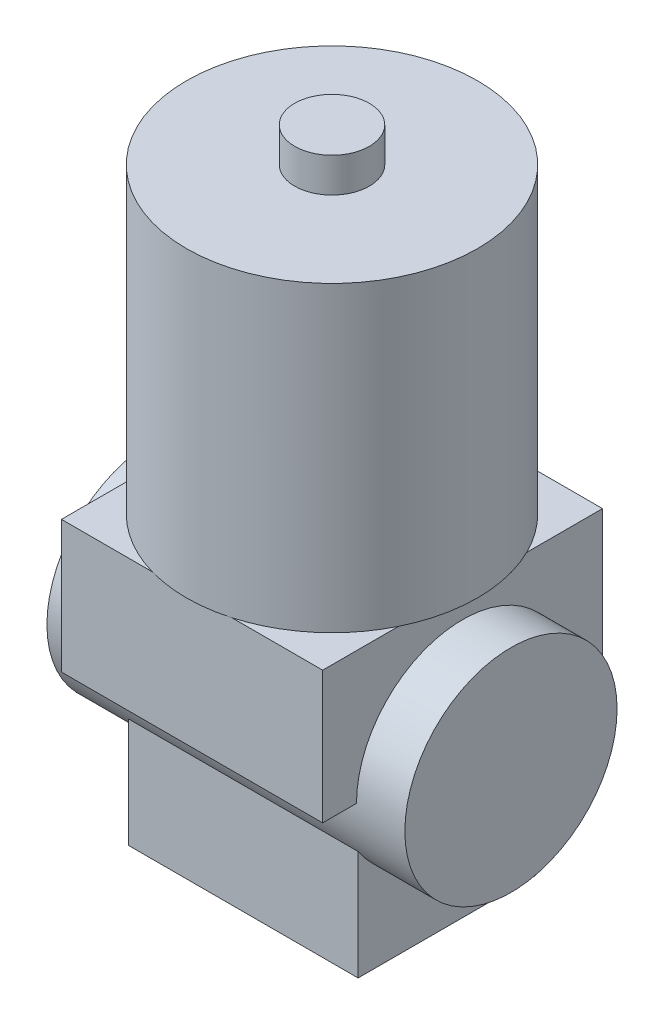
ISO-10303-21;
HEADER;
FILE_DESCRIPTION(('STEP AP214'),'2;1');
FILE_NAME('part.step','',(''),(''),'','','');
FILE_SCHEMA(('AUTOMOTIVE_DESIGN { 1 0 10303 214 1 1 1 1 }'));
ENDSEC;
DATA;
#1=APPLICATION_CONTEXT('core data for automotive mechanical design processes');
#2=APPLICATION_PROTOCOL_DEFINITION('international standard','automotive_design',2000,#1);
#3=PRODUCT_CONTEXT('',#1,'mechanical');
#4=PRODUCT('Part','Part','',(#3));
#5=PRODUCT_RELATED_PRODUCT_CATEGORY('part','',(#4));
#6=PRODUCT_DEFINITION_FORMATION('','',#4);
#7=PRODUCT_DEFINITION_CONTEXT('part definition',#1,'design');
#8=PRODUCT_DEFINITION('design','',#6,#7);
#9=PRODUCT_DEFINITION_SHAPE('','',#8);
#10=(LENGTH_UNIT() NAMED_UNIT(*) SI_UNIT(.MILLI.,.METRE.));
#11=(NAMED_UNIT(*) PLANE_ANGLE_UNIT() SI_UNIT($,.RADIAN.));
#12=(NAMED_UNIT(*) SI_UNIT($,.STERADIAN.) SOLID_ANGLE_UNIT());
#13=UNCERTAINTY_MEASURE_WITH_UNIT(LENGTH_MEASURE(1.E-05),#10,'distance_accuracy_value','');
#14=(GEOMETRIC_REPRESENTATION_CONTEXT(3) GLOBAL_UNCERTAINTY_ASSIGNED_CONTEXT((#13)) GLOBAL_UNIT_ASSIGNED_CONTEXT((#10,
#11,#12)) REPRESENTATION_CONTEXT('',''));
#15=CARTESIAN_POINT('',(0.,0.,0.));
#16=DIRECTION('',(0.,0.,1.));
#17=DIRECTION('',(1.,0.,0.));
#18=AXIS2_PLACEMENT_3D('',#15,#16,#17);
#19=CARTESIAN_POINT('',(19.185,-14.18,0.));
#20=DIRECTION('',(-1.,0.,0.));
#21=DIRECTION('',(0.,0.,1.));
#22=AXIS2_PLACEMENT_3D('',#19,#20,#21);
#23=CYLINDRICAL_SURFACE('',#22,11.375);
#24=CARTESIAN_POINT('',(-19.185,-14.18,0.));
#25=DIRECTION('',(-1.,0.,0.));
#26=DIRECTION('',(0.,0.,1.));
#27=AXIS2_PLACEMENT_3D('',#24,#25,#26);
#28=CIRCLE('',#27,11.375);
#29=CARTESIAN_POINT('',(-19.185,-14.18,11.375));
#30=VERTEX_POINT('',#29);
#31=EDGE_CURVE('E173',#30,#30,#28,.T.);
#32=ORIENTED_EDGE('',*,*,#31,.F.);
#33=EDGE_LOOP('',(#32));
#34=FACE_BOUND('',#33,.T.);
#35=CARTESIAN_POINT('',(19.185,-14.18,0.));
#36=DIRECTION('',(-1.,0.,0.));
#37=DIRECTION('',(0.,0.,1.));
#38=AXIS2_PLACEMENT_3D('',#35,#36,#37);
#39=CIRCLE('',#38,11.375);
#40=CARTESIAN_POINT('',(19.185,-14.18,11.375));
#41=VERTEX_POINT('',#40);
#42=EDGE_CURVE('E178',#41,#41,#39,.T.);
#43=ORIENTED_EDGE('',*,*,#42,.T.);
#44=EDGE_LOOP('',(#43));
#45=FACE_BOUND('',#44,.T.);
#46=DIRECTION('',(-1.,0.,0.));
#47=VECTOR('',#46,1.);
#48=CARTESIAN_POINT('',(19.185,-14.18,-11.375));
#49=LINE('',#48,#47);
#50=CARTESIAN_POINT('',(14.,-14.18,-11.375));
#51=VERTEX_POINT('',#50);
#52=CARTESIAN_POINT('',(-14.,-14.18,-11.375));
#53=VERTEX_POINT('',#52);
#54=EDGE_CURVE('E269',#51,#53,#49,.T.);
#55=ORIENTED_EDGE('',*,*,#54,.F.);
#56=CARTESIAN_POINT('',(14.,-14.18,0.));
#57=DIRECTION('',(-1.,0.,0.));
#58=DIRECTION('',(0.,0.,1.));
#59=AXIS2_PLACEMENT_3D('',#56,#57,#58);
#60=CIRCLE('',#59,11.375);
#61=CARTESIAN_POINT('',(14.,-14.18,11.375));
#62=VERTEX_POINT('',#61);
#63=EDGE_CURVE('E69',#62,#51,#60,.T.);
#64=ORIENTED_EDGE('',*,*,#63,.F.);
#65=DIRECTION('',(-1.,0.,0.));
#66=VECTOR('',#65,1.);
#67=CARTESIAN_POINT('',(19.185,-14.18,11.375));
#68=LINE('',#67,#66);
#69=CARTESIAN_POINT('',(-14.,-14.18,11.375));
#70=VERTEX_POINT('',#69);
#71=EDGE_CURVE('E266',#70,#62,#68,.F.);
#72=ORIENTED_EDGE('',*,*,#71,.F.);
#73=CARTESIAN_POINT('',(-14.,-14.18,0.));
#74=DIRECTION('',(1.,0.,0.));
#75=DIRECTION('',(0.,0.,-1.));
#76=AXIS2_PLACEMENT_3D('',#73,#74,#75);
#77=CIRCLE('',#76,11.375);
#78=EDGE_CURVE('E186',#53,#70,#77,.T.);
#79=ORIENTED_EDGE('',*,*,#78,.F.);
#80=EDGE_LOOP('',(#55,#64,#72,#79));
#81=FACE_BOUND('',#80,.T.);
#82=DIRECTION('',(-1.,0.,0.));
#83=VECTOR('',#82,1.);
#84=CARTESIAN_POINT('',(19.185,-20.4362468781211,9.5));
#85=LINE('',#84,#83);
#86=CARTESIAN_POINT('',(-12.3,-20.4362468781211,9.5));
#87=VERTEX_POINT('',#86);
#88=CARTESIAN_POINT('',(12.3,-20.4362468781211,9.5));
#89=VERTEX_POINT('',#88);
#90=EDGE_CURVE('E54',#87,#89,#85,.F.);
#91=ORIENTED_EDGE('',*,*,#90,.T.);
#92=CARTESIAN_POINT('',(12.3,-14.18,0.));
#93=DIRECTION('',(-1.,0.,0.));
#94=DIRECTION('',(0.,0.,1.));
#95=AXIS2_PLACEMENT_3D('',#92,#93,#94);
#96=CIRCLE('',#95,11.375);
#97=CARTESIAN_POINT('',(12.3,-20.4362468781211,-9.5));
#98=VERTEX_POINT('',#97);
#99=EDGE_CURVE('E11',#89,#98,#96,.F.);
#100=ORIENTED_EDGE('',*,*,#99,.T.);
#101=DIRECTION('',(-1.,0.,0.));
#102=VECTOR('',#101,1.);
#103=CARTESIAN_POINT('',(19.185,-20.4362468781211,-9.5));
#104=LINE('',#103,#102);
#105=CARTESIAN_POINT('',(-12.3,-20.4362468781211,-9.5));
#106=VERTEX_POINT('',#105);
#107=EDGE_CURVE('E273',#98,#106,#104,.T.);
#108=ORIENTED_EDGE('',*,*,#107,.T.);
#109=CARTESIAN_POINT('',(-12.3,-14.18,0.));
#110=DIRECTION('',(1.,0.,0.));
#111=DIRECTION('',(0.,0.,-1.));
#112=AXIS2_PLACEMENT_3D('',#109,#110,#111);
#113=CIRCLE('',#112,11.375);
#114=EDGE_CURVE('E277',#106,#87,#113,.F.);
#115=ORIENTED_EDGE('',*,*,#114,.T.);
#116=EDGE_LOOP('',(#91,#100,#108,#115));
#117=FACE_BOUND('',#116,.T.);
#118=ADVANCED_FACE('F45',(#34,#45,#81,#117),#23,.T.);
#119=CARTESIAN_POINT('',(0.,-14.18,0.));
#120=DIRECTION('',(0.,1.,0.));
#121=DIRECTION('',(0.,0.,1.));
#122=AXIS2_PLACEMENT_3D('',#119,#120,#121);
#123=PLANE('',#122);
#124=DIRECTION('',(0.,0.,1.));
#125=VECTOR('',#124,1.);
#126=CARTESIAN_POINT('',(14.,-14.18,-15.));
#127=LINE('',#126,#125);
#128=CARTESIAN_POINT('',(14.,-14.18,-15.));
#129=VERTEX_POINT('',#128);
#130=EDGE_CURVE('E193',#129,#51,#127,.T.);
#131=ORIENTED_EDGE('',*,*,#130,.T.);
#132=ORIENTED_EDGE('',*,*,#54,.T.);
#133=DIRECTION('',(0.,0.,-1.));
#134=VECTOR('',#133,1.);
#135=CARTESIAN_POINT('',(-14.,-14.18,-15.));
#136=LINE('',#135,#134);
#137=CARTESIAN_POINT('',(-14.,-14.18,-15.));
#138=VERTEX_POINT('',#137);
#139=EDGE_CURVE('E201',#53,#138,#136,.T.);
#140=ORIENTED_EDGE('',*,*,#139,.T.);
#141=DIRECTION('',(1.,0.,0.));
#142=VECTOR('',#141,1.);
#143=CARTESIAN_POINT('',(-14.,-14.18,-15.));
#144=LINE('',#143,#142);
#145=EDGE_CURVE('E206',#138,#129,#144,.T.);
#146=ORIENTED_EDGE('',*,*,#145,.T.);
#147=EDGE_LOOP('',(#131,#132,#140,#146));
#148=FACE_BOUND('',#147,.T.);
#149=ADVANCED_FACE('F304',(#148),#123,.F.);
#150=CARTESIAN_POINT('',(0.,0.,0.));
#151=DIRECTION('',(0.,1.,0.));
#152=DIRECTION('',(0.,0.,1.));
#153=AXIS2_PLACEMENT_3D('',#150,#151,#152);
#154=PLANE('',#153);
#155=DIRECTION('',(0.,0.,1.));
#156=VECTOR('',#155,1.);
#157=CARTESIAN_POINT('',(14.,0.,-15.));
#158=LINE('',#157,#156);
#159=CARTESIAN_POINT('',(14.,0.,-6.87051853938261));
#160=VERTEX_POINT('',#159);
#161=CARTESIAN_POINT('',(14.,0.,6.87051853938261));
#162=VERTEX_POINT('',#161);
#163=EDGE_CURVE('E215',#160,#162,#158,.T.);
#164=ORIENTED_EDGE('',*,*,#163,.F.);
#165=CARTESIAN_POINT('',(0.,0.,0.));
#166=DIRECTION('',(0.,1.,0.));
#167=DIRECTION('',(0.,0.,1.));
#168=AXIS2_PLACEMENT_3D('',#165,#166,#167);
#169=CIRCLE('',#168,15.595);
#170=EDGE_CURVE('E265',#162,#160,#169,.T.);
#171=ORIENTED_EDGE('',*,*,#170,.F.);
#172=EDGE_LOOP('',(#164,#171));
#173=FACE_BOUND('',#172,.T.);
#174=ADVANCED_FACE('F312',(#173),#154,.F.);
#175=DIRECTION('',(1.,0.,0.));
#176=VECTOR('',#175,1.);
#177=CARTESIAN_POINT('',(-14.,0.,-15.));
#178=LINE('',#177,#176);
#179=CARTESIAN_POINT('',(-4.2666175127377,0.,-15.));
#180=VERTEX_POINT('',#179);
#181=CARTESIAN_POINT('',(4.2666175127377,0.,-15.));
#182=VERTEX_POINT('',#181);
#183=EDGE_CURVE('E232',#180,#182,#178,.T.);
#184=ORIENTED_EDGE('',*,*,#183,.F.);
#185=EDGE_CURVE('E411',#182,#180,#169,.T.);
#186=ORIENTED_EDGE('',*,*,#185,.F.);
#187=EDGE_LOOP('',(#184,#186));
#188=FACE_BOUND('',#187,.T.);
#189=ADVANCED_FACE('F358',(#188),#154,.F.);
#190=DIRECTION('',(0.,0.,-1.));
#191=VECTOR('',#190,1.);
#192=CARTESIAN_POINT('',(-14.,0.,-15.));
#193=LINE('',#192,#191);
#194=CARTESIAN_POINT('',(-14.,0.,6.8705185393826));
#195=VERTEX_POINT('',#194);
#196=CARTESIAN_POINT('',(-14.,0.,-6.8705185393826));
#197=VERTEX_POINT('',#196);
#198=EDGE_CURVE('E227',#195,#197,#193,.T.);
#199=ORIENTED_EDGE('',*,*,#198,.F.);
#200=EDGE_CURVE('E418',#197,#195,#169,.T.);
#201=ORIENTED_EDGE('',*,*,#200,.F.);
#202=EDGE_LOOP('',(#199,#201));
#203=FACE_BOUND('',#202,.T.);
#204=ADVANCED_FACE('F364',(#203),#154,.F.);
#205=DIRECTION('',(-1.,0.,0.));
#206=VECTOR('',#205,1.);
#207=CARTESIAN_POINT('',(-14.,0.,15.));
#208=LINE('',#207,#206);
#209=CARTESIAN_POINT('',(4.26661751273772,0.,15.));
#210=VERTEX_POINT('',#209);
#211=CARTESIAN_POINT('',(-4.26661751273772,0.,15.));
#212=VERTEX_POINT('',#211);
#213=EDGE_CURVE('E221',#210,#212,#208,.T.);
#214=ORIENTED_EDGE('',*,*,#213,.F.);
#215=EDGE_CURVE('E252',#212,#210,#169,.T.);
#216=ORIENTED_EDGE('',*,*,#215,.F.);
#217=EDGE_LOOP('',(#214,#216));
#218=FACE_BOUND('',#217,.T.);
#219=ADVANCED_FACE('F360',(#218),#154,.F.);
#220=CARTESIAN_POINT('',(0.,32.43,0.));
#221=DIRECTION('',(0.,-1.,0.));
#222=DIRECTION('',(0.,0.,-1.));
#223=AXIS2_PLACEMENT_3D('',#220,#221,#222);
#224=CYLINDRICAL_SURFACE('',#223,15.595);
#225=CARTESIAN_POINT('',(0.,32.43,0.));
#226=DIRECTION('',(0.,1.,0.));
#227=DIRECTION('',(0.,0.,1.));
#228=AXIS2_PLACEMENT_3D('',#225,#226,#227);
#229=CIRCLE('',#228,15.595);
#230=CARTESIAN_POINT('',(0.,32.43,15.595));
#231=VERTEX_POINT('',#230);
#232=EDGE_CURVE('E257',#231,#231,#229,.T.);
#233=ORIENTED_EDGE('',*,*,#232,.F.);
#234=EDGE_LOOP('',(#233));
#235=FACE_BOUND('',#234,.T.);
#236=EDGE_CURVE('E261',#210,#162,#169,.T.);
#237=ORIENTED_EDGE('',*,*,#236,.T.);
#238=ORIENTED_EDGE('',*,*,#170,.T.);
#239=EDGE_CURVE('E408',#160,#182,#169,.T.);
#240=ORIENTED_EDGE('',*,*,#239,.T.);
#241=ORIENTED_EDGE('',*,*,#185,.T.);
#242=EDGE_CURVE('E414',#180,#197,#169,.T.);
#243=ORIENTED_EDGE('',*,*,#242,.T.);
#244=ORIENTED_EDGE('',*,*,#200,.T.);
#245=EDGE_CURVE('E385',#195,#212,#169,.T.);
#246=ORIENTED_EDGE('',*,*,#245,.T.);
#247=ORIENTED_EDGE('',*,*,#215,.T.);
#248=EDGE_LOOP('',(#237,#238,#240,#241,#243,#244,#246,#247));
#249=FACE_BOUND('',#248,.T.);
#250=ADVANCED_FACE('F47',(#235,#249),#224,.T.);
#251=CARTESIAN_POINT('',(0.,32.43,0.));
#252=DIRECTION('',(0.,1.,0.));
#253=DIRECTION('',(0.,0.,1.));
#254=AXIS2_PLACEMENT_3D('',#251,#252,#253);
#255=PLANE('',#254);
#256=CARTESIAN_POINT('',(0.,32.43,0.));
#257=DIRECTION('',(0.,1.,0.));
#258=DIRECTION('',(0.,0.,1.));
#259=AXIS2_PLACEMENT_3D('',#256,#257,#258);
#260=CIRCLE('',#259,4.);
#261=CARTESIAN_POINT('',(0.,32.43,4.));
#262=VERTEX_POINT('',#261);
#263=EDGE_CURVE('E253',#262,#262,#260,.T.);
#264=ORIENTED_EDGE('',*,*,#263,.F.);
#265=EDGE_LOOP('',(#264));
#266=FACE_BOUND('',#265,.T.);
#267=ORIENTED_EDGE('',*,*,#232,.T.);
#268=EDGE_LOOP('',(#267));
#269=FACE_BOUND('',#268,.T.);
#270=ADVANCED_FACE('F353',(#266,#269),#255,.T.);
#271=CARTESIAN_POINT('',(0.,36.13,0.));
#272=DIRECTION('',(0.,-1.,0.));
#273=DIRECTION('',(0.,0.,-1.));
#274=AXIS2_PLACEMENT_3D('',#271,#272,#273);
#275=CYLINDRICAL_SURFACE('',#274,4.);
#276=CARTESIAN_POINT('',(0.,36.13,0.));
#277=DIRECTION('',(0.,1.,0.));
#278=DIRECTION('',(0.,0.,1.));
#279=AXIS2_PLACEMENT_3D('',#276,#277,#278);
#280=CIRCLE('',#279,4.);
#281=CARTESIAN_POINT('',(0.,36.13,4.));
#282=VERTEX_POINT('',#281);
#283=EDGE_CURVE('E248',#282,#282,#280,.T.);
#284=ORIENTED_EDGE('',*,*,#283,.F.);
#285=EDGE_LOOP('',(#284));
#286=FACE_BOUND('',#285,.T.);
#287=ORIENTED_EDGE('',*,*,#263,.T.);
#288=EDGE_LOOP('',(#287));
#289=FACE_BOUND('',#288,.T.);
#290=ADVANCED_FACE('F349',(#286,#289),#275,.T.);
#291=CARTESIAN_POINT('',(0.,36.13,0.));
#292=DIRECTION('',(0.,1.,0.));
#293=DIRECTION('',(0.,0.,1.));
#294=AXIS2_PLACEMENT_3D('',#291,#292,#293);
#295=PLANE('',#294);
#296=ORIENTED_EDGE('',*,*,#283,.T.);
#297=EDGE_LOOP('',(#296));
#298=FACE_BOUND('',#297,.T.);
#299=ADVANCED_FACE('F329',(#298),#295,.T.);
#300=CARTESIAN_POINT('',(0.,0.,0.));
#301=DIRECTION('',(0.,1.,0.));
#302=DIRECTION('',(0.,0.,1.));
#303=AXIS2_PLACEMENT_3D('',#300,#301,#302);
#304=PLANE('',#303);
#305=ORIENTED_EDGE('',*,*,#236,.F.);
#306=CARTESIAN_POINT('',(14.,0.,15.));
#307=VERTEX_POINT('',#306);
#308=EDGE_CURVE('E216',#307,#210,#208,.T.);
#309=ORIENTED_EDGE('',*,*,#308,.F.);
#310=EDGE_CURVE('E192',#162,#307,#158,.T.);
#311=ORIENTED_EDGE('',*,*,#310,.F.);
#312=EDGE_LOOP('',(#305,#309,#311));
#313=FACE_BOUND('',#312,.T.);
#314=ADVANCED_FACE('F325',(#313),#304,.T.);
#315=ORIENTED_EDGE('',*,*,#239,.F.);
#316=CARTESIAN_POINT('',(14.,0.,-15.));
#317=VERTEX_POINT('',#316);
#318=EDGE_CURVE('E210',#317,#160,#158,.T.);
#319=ORIENTED_EDGE('',*,*,#318,.F.);
#320=EDGE_CURVE('E226',#182,#317,#178,.T.);
#321=ORIENTED_EDGE('',*,*,#320,.F.);
#322=EDGE_LOOP('',(#315,#319,#321));
#323=FACE_BOUND('',#322,.T.);
#324=ADVANCED_FACE('F328',(#323),#304,.T.);
#325=ORIENTED_EDGE('',*,*,#242,.F.);
#326=CARTESIAN_POINT('',(-14.,0.,-15.));
#327=VERTEX_POINT('',#326);
#328=EDGE_CURVE('E228',#327,#180,#178,.T.);
#329=ORIENTED_EDGE('',*,*,#328,.F.);
#330=EDGE_CURVE('E220',#197,#327,#193,.T.);
#331=ORIENTED_EDGE('',*,*,#330,.F.);
#332=EDGE_LOOP('',(#325,#329,#331));
#333=FACE_BOUND('',#332,.T.);
#334=ADVANCED_FACE('F429',(#333),#304,.T.);
#335=ORIENTED_EDGE('',*,*,#245,.F.);
#336=CARTESIAN_POINT('',(-14.,0.,15.));
#337=VERTEX_POINT('',#336);
#338=EDGE_CURVE('E222',#337,#195,#193,.T.);
#339=ORIENTED_EDGE('',*,*,#338,.F.);
#340=EDGE_CURVE('E214',#212,#337,#208,.T.);
#341=ORIENTED_EDGE('',*,*,#340,.F.);
#342=EDGE_LOOP('',(#335,#339,#341));
#343=FACE_BOUND('',#342,.T.);
#344=ADVANCED_FACE('F331',(#343),#304,.T.);
#345=CARTESIAN_POINT('',(14.,-14.18,-15.));
#346=DIRECTION('',(-1.,0.,0.));
#347=DIRECTION('',(0.,0.,1.));
#348=AXIS2_PLACEMENT_3D('',#345,#346,#347);
#349=PLANE('',#348);
#350=CARTESIAN_POINT('',(14.,-14.18,15.));
#351=VERTEX_POINT('',#350);
#352=EDGE_CURVE('E198',#62,#351,#127,.T.);
#353=ORIENTED_EDGE('',*,*,#352,.F.);
#354=ORIENTED_EDGE('',*,*,#63,.T.);
#355=ORIENTED_EDGE('',*,*,#130,.F.);
#356=DIRECTION('',(0.,1.,0.));
#357=VECTOR('',#356,1.);
#358=CARTESIAN_POINT('',(14.,-14.18,-15.));
#359=LINE('',#358,#357);
#360=EDGE_CURVE('E209',#129,#317,#359,.T.);
#361=ORIENTED_EDGE('',*,*,#360,.T.);
#362=ORIENTED_EDGE('',*,*,#318,.T.);
#363=ORIENTED_EDGE('',*,*,#163,.T.);
#364=ORIENTED_EDGE('',*,*,#310,.T.);
#365=DIRECTION('',(0.,1.,0.));
#366=VECTOR('',#365,1.);
#367=CARTESIAN_POINT('',(14.,-14.18,15.));
#368=LINE('',#367,#366);
#369=EDGE_CURVE('E244',#351,#307,#368,.T.);
#370=ORIENTED_EDGE('',*,*,#369,.F.);
#371=EDGE_LOOP('',(#353,#354,#355,#361,#362,#363,#364,#370));
#372=FACE_BOUND('',#371,.T.);
#373=ADVANCED_FACE('F342',(#372),#349,.F.);
#374=CARTESIAN_POINT('',(-14.,-14.18,15.));
#375=DIRECTION('',(0.,0.,-1.));
#376=DIRECTION('',(-1.,0.,0.));
#377=AXIS2_PLACEMENT_3D('',#374,#375,#376);
#378=PLANE('',#377);
#379=ORIENTED_EDGE('',*,*,#308,.T.);
#380=ORIENTED_EDGE('',*,*,#213,.T.);
#381=ORIENTED_EDGE('',*,*,#340,.T.);
#382=DIRECTION('',(0.,1.,0.));
#383=VECTOR('',#382,1.);
#384=CARTESIAN_POINT('',(-14.,-14.18,15.));
#385=LINE('',#384,#383);
#386=CARTESIAN_POINT('',(-14.,-14.18,15.));
#387=VERTEX_POINT('',#386);
#388=EDGE_CURVE('E240',#387,#337,#385,.T.);
#389=ORIENTED_EDGE('',*,*,#388,.F.);
#390=DIRECTION('',(-1.,0.,0.));
#391=VECTOR('',#390,1.);
#392=CARTESIAN_POINT('',(-14.,-14.18,15.));
#393=LINE('',#392,#391);
#394=EDGE_CURVE('E197',#351,#387,#393,.T.);
#395=ORIENTED_EDGE('',*,*,#394,.F.);
#396=ORIENTED_EDGE('',*,*,#369,.T.);
#397=EDGE_LOOP('',(#379,#380,#381,#389,#395,#396));
#398=FACE_BOUND('',#397,.T.);
#399=ADVANCED_FACE('F338',(#398),#378,.F.);
#400=CARTESIAN_POINT('',(-14.,-14.18,-15.));
#401=DIRECTION('',(1.,0.,0.));
#402=DIRECTION('',(0.,0.,-1.));
#403=AXIS2_PLACEMENT_3D('',#400,#401,#402);
#404=PLANE('',#403);
#405=ORIENTED_EDGE('',*,*,#139,.F.);
#406=ORIENTED_EDGE('',*,*,#78,.T.);
#407=EDGE_CURVE('E202',#387,#70,#136,.T.);
#408=ORIENTED_EDGE('',*,*,#407,.F.);
#409=ORIENTED_EDGE('',*,*,#388,.T.);
#410=ORIENTED_EDGE('',*,*,#338,.T.);
#411=ORIENTED_EDGE('',*,*,#198,.T.);
#412=ORIENTED_EDGE('',*,*,#330,.T.);
#413=DIRECTION('',(0.,1.,0.));
#414=VECTOR('',#413,1.);
#415=CARTESIAN_POINT('',(-14.,-14.18,-15.));
#416=LINE('',#415,#414);
#417=EDGE_CURVE('E236',#138,#327,#416,.T.);
#418=ORIENTED_EDGE('',*,*,#417,.F.);
#419=EDGE_LOOP('',(#405,#406,#408,#409,#410,#411,#412,#418));
#420=FACE_BOUND('',#419,.T.);
#421=ADVANCED_FACE('F334',(#420),#404,.F.);
#422=CARTESIAN_POINT('',(-14.,-14.18,-15.));
#423=DIRECTION('',(0.,0.,1.));
#424=DIRECTION('',(1.,0.,0.));
#425=AXIS2_PLACEMENT_3D('',#422,#423,#424);
#426=PLANE('',#425);
#427=ORIENTED_EDGE('',*,*,#328,.T.);
#428=ORIENTED_EDGE('',*,*,#183,.T.);
#429=ORIENTED_EDGE('',*,*,#320,.T.);
#430=ORIENTED_EDGE('',*,*,#360,.F.);
#431=ORIENTED_EDGE('',*,*,#145,.F.);
#432=ORIENTED_EDGE('',*,*,#417,.T.);
#433=EDGE_LOOP('',(#427,#428,#429,#430,#431,#432));
#434=FACE_BOUND('',#433,.T.);
#435=ADVANCED_FACE('F323',(#434),#426,.F.);
#436=ORIENTED_EDGE('',*,*,#407,.T.);
#437=ORIENTED_EDGE('',*,*,#71,.T.);
#438=ORIENTED_EDGE('',*,*,#352,.T.);
#439=ORIENTED_EDGE('',*,*,#394,.T.);
#440=EDGE_LOOP('',(#436,#437,#438,#439));
#441=FACE_BOUND('',#440,.T.);
#442=ADVANCED_FACE('F315',(#441),#123,.F.);
#443=CARTESIAN_POINT('',(19.185,-14.18,0.));
#444=DIRECTION('',(-1.,0.,0.));
#445=DIRECTION('',(0.,0.,1.));
#446=AXIS2_PLACEMENT_3D('',#443,#444,#445);
#447=PLANE('',#446);
#448=ORIENTED_EDGE('',*,*,#42,.F.);
#449=EDGE_LOOP('',(#448));
#450=FACE_BOUND('',#449,.T.);
#451=ADVANCED_FACE('F319',(#450),#447,.F.);
#452=CARTESIAN_POINT('',(-19.185,-14.18,0.));
#453=DIRECTION('',(-1.,0.,0.));
#454=DIRECTION('',(0.,0.,1.));
#455=AXIS2_PLACEMENT_3D('',#452,#453,#454);
#456=PLANE('',#455);
#457=ORIENTED_EDGE('',*,*,#31,.T.);
#458=EDGE_LOOP('',(#457));
#459=FACE_BOUND('',#458,.T.);
#460=ADVANCED_FACE('F539',(#459),#456,.T.);
#461=CARTESIAN_POINT('',(12.3,-32.18,-9.5));
#462=DIRECTION('',(-1.,0.,0.));
#463=DIRECTION('',(0.,0.,1.));
#464=AXIS2_PLACEMENT_3D('',#461,#462,#463);
#465=PLANE('',#464);
#466=ORIENTED_EDGE('',*,*,#99,.F.);
#467=DIRECTION('',(0.,1.,0.));
#468=VECTOR('',#467,1.);
#469=CARTESIAN_POINT('',(12.3,-32.18,9.5));
#470=LINE('',#469,#468);
#471=CARTESIAN_POINT('',(12.3,-32.18,9.5));
#472=VERTEX_POINT('',#471);
#473=EDGE_CURVE('E152',#472,#89,#470,.T.);
#474=ORIENTED_EDGE('',*,*,#473,.F.);
#475=DIRECTION('',(0.,0.,1.));
#476=VECTOR('',#475,1.);
#477=CARTESIAN_POINT('',(12.3,-32.18,-9.5));
#478=LINE('',#477,#476);
#479=CARTESIAN_POINT('',(12.3,-32.18,-9.5));
#480=VERTEX_POINT('',#479);
#481=EDGE_CURVE('E160',#480,#472,#478,.T.);
#482=ORIENTED_EDGE('',*,*,#481,.F.);
#483=DIRECTION('',(0.,1.,0.));
#484=VECTOR('',#483,1.);
#485=CARTESIAN_POINT('',(12.3,-32.18,-9.5));
#486=LINE('',#485,#484);
#487=EDGE_CURVE('E287',#480,#98,#486,.T.);
#488=ORIENTED_EDGE('',*,*,#487,.T.);
#489=EDGE_LOOP('',(#466,#474,#482,#488));
#490=FACE_BOUND('',#489,.T.);
#491=ADVANCED_FACE('F171',(#490),#465,.F.);
#492=CARTESIAN_POINT('',(-12.3,-32.18,9.5));
#493=DIRECTION('',(0.,0.,-1.));
#494=DIRECTION('',(-1.,0.,0.));
#495=AXIS2_PLACEMENT_3D('',#492,#493,#494);
#496=PLANE('',#495);
#497=ORIENTED_EDGE('',*,*,#90,.F.);
#498=DIRECTION('',(0.,1.,0.));
#499=VECTOR('',#498,1.);
#500=CARTESIAN_POINT('',(-12.3,-32.18,9.5));
#501=LINE('',#500,#499);
#502=CARTESIAN_POINT('',(-12.3,-32.18,9.5));
#503=VERTEX_POINT('',#502);
#504=EDGE_CURVE('E155',#503,#87,#501,.T.);
#505=ORIENTED_EDGE('',*,*,#504,.F.);
#506=DIRECTION('',(-1.,0.,0.));
#507=VECTOR('',#506,1.);
#508=CARTESIAN_POINT('',(-12.3,-32.18,9.5));
#509=LINE('',#508,#507);
#510=EDGE_CURVE('E148',#472,#503,#509,.T.);
#511=ORIENTED_EDGE('',*,*,#510,.F.);
#512=ORIENTED_EDGE('',*,*,#473,.T.);
#513=EDGE_LOOP('',(#497,#505,#511,#512));
#514=FACE_BOUND('',#513,.T.);
#515=ADVANCED_FACE('F150',(#514),#496,.F.);
#516=CARTESIAN_POINT('',(-12.3,-32.18,-9.5));
#517=DIRECTION('',(1.,0.,0.));
#518=DIRECTION('',(0.,0.,-1.));
#519=AXIS2_PLACEMENT_3D('',#516,#517,#518);
#520=PLANE('',#519);
#521=ORIENTED_EDGE('',*,*,#114,.F.);
#522=DIRECTION('',(0.,1.,0.));
#523=VECTOR('',#522,1.);
#524=CARTESIAN_POINT('',(-12.3,-32.18,-9.5));
#525=LINE('',#524,#523);
#526=CARTESIAN_POINT('',(-12.3,-32.18,-9.5));
#527=VERTEX_POINT('',#526);
#528=EDGE_CURVE('E61',#527,#106,#525,.T.);
#529=ORIENTED_EDGE('',*,*,#528,.F.);
#530=DIRECTION('',(0.,0.,-1.));
#531=VECTOR('',#530,1.);
#532=CARTESIAN_POINT('',(-12.3,-32.18,-9.5));
#533=LINE('',#532,#531);
#534=EDGE_CURVE('E159',#503,#527,#533,.T.);
#535=ORIENTED_EDGE('',*,*,#534,.F.);
#536=ORIENTED_EDGE('',*,*,#504,.T.);
#537=EDGE_LOOP('',(#521,#529,#535,#536));
#538=FACE_BOUND('',#537,.T.);
#539=ADVANCED_FACE('F283',(#538),#520,.F.);
#540=CARTESIAN_POINT('',(-12.3,-32.18,-9.5));
#541=DIRECTION('',(0.,0.,1.));
#542=DIRECTION('',(1.,0.,0.));
#543=AXIS2_PLACEMENT_3D('',#540,#541,#542);
#544=PLANE('',#543);
#545=ORIENTED_EDGE('',*,*,#107,.F.);
#546=ORIENTED_EDGE('',*,*,#487,.F.);
#547=DIRECTION('',(1.,0.,0.));
#548=VECTOR('',#547,1.);
#549=CARTESIAN_POINT('',(-12.3,-32.18,-9.5));
#550=LINE('',#549,#548);
#551=EDGE_CURVE('E164',#527,#480,#550,.T.);
#552=ORIENTED_EDGE('',*,*,#551,.F.);
#553=ORIENTED_EDGE('',*,*,#528,.T.);
#554=EDGE_LOOP('',(#545,#546,#552,#553));
#555=FACE_BOUND('',#554,.T.);
#556=ADVANCED_FACE('F292',(#555),#544,.F.);
#557=CARTESIAN_POINT('',(0.,-32.18,0.));
#558=DIRECTION('',(0.,1.,0.));
#559=DIRECTION('',(0.,0.,1.));
#560=AXIS2_PLACEMENT_3D('',#557,#558,#559);
#561=PLANE('',#560);
#562=CARTESIAN_POINT('',(0.,-32.18,5.595));
#563=DIRECTION('',(0.,-1.,0.));
#564=DIRECTION('',(0.,0.,-1.));
#565=AXIS2_PLACEMENT_3D('',#562,#563,#564);
#566=CIRCLE('',#565,1.7419155899058);
#567=CARTESIAN_POINT('',(0.,-32.18,3.8530844100942));
#568=VERTEX_POINT('',#567);
#569=EDGE_CURVE('E622',#568,#568,#566,.T.);
#570=ORIENTED_EDGE('',*,*,#569,.F.);
#571=EDGE_LOOP('',(#570));
#572=FACE_BOUND('',#571,.T.);
#573=CARTESIAN_POINT('',(0.,-32.18,-5.595));
#574=DIRECTION('',(0.,-1.,0.));
#575=DIRECTION('',(0.,0.,-1.));
#576=AXIS2_PLACEMENT_3D('',#573,#574,#575);
#577=CIRCLE('',#576,1.7419155899058);
#578=CARTESIAN_POINT('',(0.,-32.18,-7.3369155899058));
#579=VERTEX_POINT('',#578);
#580=EDGE_CURVE('E628',#579,#579,#577,.T.);
#581=ORIENTED_EDGE('',*,*,#580,.F.);
#582=EDGE_LOOP('',(#581));
#583=FACE_BOUND('',#582,.T.);
#584=ORIENTED_EDGE('',*,*,#481,.T.);
#585=ORIENTED_EDGE('',*,*,#510,.T.);
#586=ORIENTED_EDGE('',*,*,#534,.T.);
#587=ORIENTED_EDGE('',*,*,#551,.T.);
#588=EDGE_LOOP('',(#584,#585,#586,#587));
#589=FACE_BOUND('',#588,.T.);
#590=ADVANCED_FACE('F163',(#572,#583,#589),#561,.F.);
#591=CARTESIAN_POINT('',(0.,-14.18,0.));
#592=DIRECTION('',(0.,1.,0.));
#593=DIRECTION('',(0.,0.,1.));
#594=AXIS2_PLACEMENT_3D('',#591,#592,#593);
#595=PLANE('',#594);
#596=CARTESIAN_POINT('',(0.,-14.18,-5.595));
#597=DIRECTION('',(0.,1.,0.));
#598=DIRECTION('',(0.,0.,1.));
#599=AXIS2_PLACEMENT_3D('',#596,#597,#598);
#600=CIRCLE('',#599,1.7419155899058);
#601=CARTESIAN_POINT('',(0.,-14.18,-3.8530844100942));
#602=VERTEX_POINT('',#601);
#603=EDGE_CURVE('E631',#602,#602,#600,.F.);
#604=ORIENTED_EDGE('',*,*,#603,.T.);
#605=EDGE_LOOP('',(#604));
#606=FACE_BOUND('',#605,.T.);
#607=ADVANCED_FACE('F299',(#606),#595,.F.);
#608=CARTESIAN_POINT('',(0.,-9.25311869649217,-5.595));
#609=DIRECTION('',(0.,-1.,0.));
#610=DIRECTION('',(0.,0.,-1.));
#611=AXIS2_PLACEMENT_3D('',#608,#609,#610);
#612=CYLINDRICAL_SURFACE('',#611,1.7419155899058);
#613=ORIENTED_EDGE('',*,*,#580,.T.);
#614=EDGE_LOOP('',(#613));
#615=FACE_BOUND('',#614,.T.);
#616=ORIENTED_EDGE('',*,*,#603,.F.);
#617=EDGE_LOOP('',(#616));
#618=FACE_BOUND('',#617,.T.);
#619=ADVANCED_FACE('F584',(#615,#618),#612,.F.);
#620=CARTESIAN_POINT('',(0.,-14.18,0.));
#621=DIRECTION('',(0.,1.,0.));
#622=DIRECTION('',(0.,0.,1.));
#623=AXIS2_PLACEMENT_3D('',#620,#621,#622);
#624=PLANE('',#623);
#625=CARTESIAN_POINT('',(0.,-14.18,5.595));
#626=DIRECTION('',(0.,1.,0.));
#627=DIRECTION('',(0.,0.,1.));
#628=AXIS2_PLACEMENT_3D('',#625,#626,#627);
#629=CIRCLE('',#628,1.7419155899058);
#630=CARTESIAN_POINT('',(0.,-14.18,7.3369155899058));
#631=VERTEX_POINT('',#630);
#632=EDGE_CURVE('E169',#631,#631,#629,.F.);
#633=ORIENTED_EDGE('',*,*,#632,.T.);
#634=EDGE_LOOP('',(#633));
#635=FACE_BOUND('',#634,.T.);
#636=ADVANCED_FACE('F593',(#635),#624,.F.);
#637=CARTESIAN_POINT('',(0.,-9.25311869649217,5.595));
#638=DIRECTION('',(0.,-1.,0.));
#639=DIRECTION('',(0.,0.,-1.));
#640=AXIS2_PLACEMENT_3D('',#637,#638,#639);
#641=CYLINDRICAL_SURFACE('',#640,1.7419155899058);
#642=ORIENTED_EDGE('',*,*,#569,.T.);
#643=EDGE_LOOP('',(#642));
#644=FACE_BOUND('',#643,.T.);
#645=ORIENTED_EDGE('',*,*,#632,.F.);
#646=EDGE_LOOP('',(#645));
#647=FACE_BOUND('',#646,.T.);
#648=ADVANCED_FACE('F602',(#644,#647),#641,.F.);
#649=CLOSED_SHELL('',(#118,#149,#174,#189,#204,#219,#250,#270,#290,#299,#314,#324,#334,#344,
#373,#399,#421,#435,#442,#451,#460,#491,#515,#539,#556,#590,#607,#619,#636,#648));
#650=MANIFOLD_SOLID_BREP('B2',#649);
#651=ADVANCED_BREP_SHAPE_REPRESENTATION('',(#18,#650),#14);
#652=SHAPE_DEFINITION_REPRESENTATION(#9,#651);
ENDSEC;
END-ISO-10303-21;
